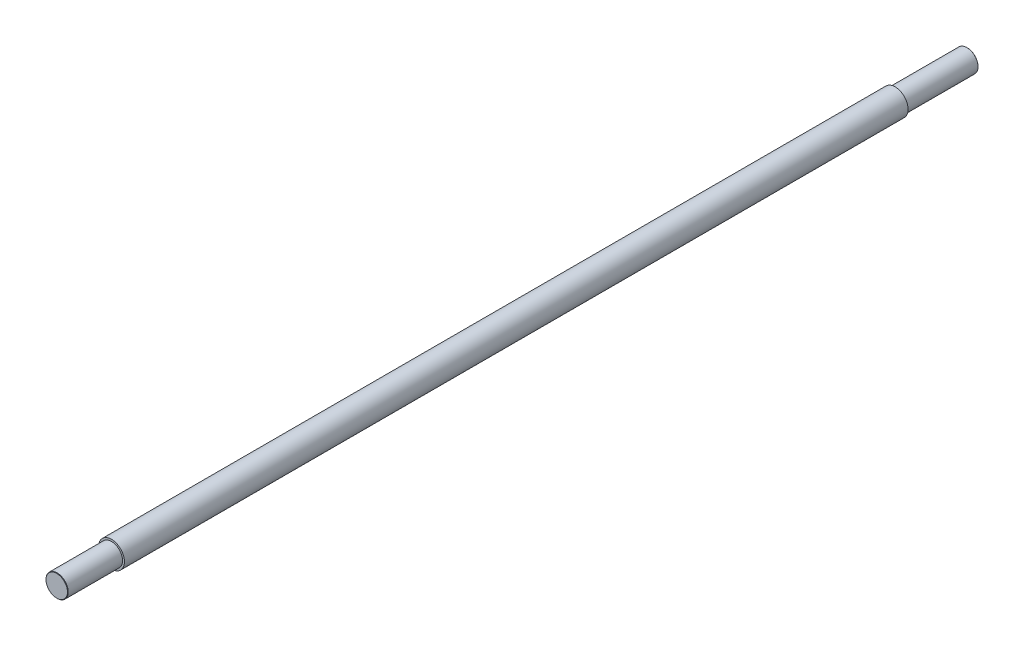
ISO-10303-21;
HEADER;
FILE_DESCRIPTION(('STEP AP214'),'2;1');
FILE_NAME('part.step','',(''),(''),'','','');
FILE_SCHEMA(('AUTOMOTIVE_DESIGN { 1 0 10303 214 1 1 1 1 }'));
ENDSEC;
DATA;
#1=APPLICATION_CONTEXT('core data for automotive mechanical design processes');
#2=APPLICATION_PROTOCOL_DEFINITION('international standard','automotive_design',2000,#1);
#3=PRODUCT_CONTEXT('',#1,'mechanical');
#4=PRODUCT('Part','Part','',(#3));
#5=PRODUCT_RELATED_PRODUCT_CATEGORY('part','',(#4));
#6=PRODUCT_DEFINITION_FORMATION('','',#4);
#7=PRODUCT_DEFINITION_CONTEXT('part definition',#1,'design');
#8=PRODUCT_DEFINITION('design','',#6,#7);
#9=PRODUCT_DEFINITION_SHAPE('','',#8);
#10=(LENGTH_UNIT() NAMED_UNIT(*) SI_UNIT(.MILLI.,.METRE.));
#11=(NAMED_UNIT(*) PLANE_ANGLE_UNIT() SI_UNIT($,.RADIAN.));
#12=(NAMED_UNIT(*) SI_UNIT($,.STERADIAN.) SOLID_ANGLE_UNIT());
#13=UNCERTAINTY_MEASURE_WITH_UNIT(LENGTH_MEASURE(1.E-05),#10,'distance_accuracy_value','');
#14=(GEOMETRIC_REPRESENTATION_CONTEXT(3) GLOBAL_UNCERTAINTY_ASSIGNED_CONTEXT((#13)) GLOBAL_UNIT_ASSIGNED_CONTEXT((#10,
#11,#12)) REPRESENTATION_CONTEXT('',''));
#15=CARTESIAN_POINT('',(0.,0.,0.));
#16=DIRECTION('',(0.,0.,1.));
#17=DIRECTION('',(1.,0.,0.));
#18=AXIS2_PLACEMENT_3D('',#15,#16,#17);
#19=CARTESIAN_POINT('',(0.,0.,0.));
#20=DIRECTION('',(0.,0.,-1.));
#21=DIRECTION('',(0.,1.,0.));
#22=AXIS2_PLACEMENT_3D('',#19,#20,#21);
#23=PLANE('',#22);
#24=CARTESIAN_POINT('',(0.,0.,0.));
#25=DIRECTION('',(0.,0.,-1.));
#26=DIRECTION('',(0.,1.,0.));
#27=AXIS2_PLACEMENT_3D('',#24,#25,#26);
#28=CIRCLE('',#27,28.9999999999999);
#29=CARTESIAN_POINT('',(0.,28.9999999999999,0.));
#30=VERTEX_POINT('',#29);
#31=EDGE_CURVE('E39',#30,#30,#28,.F.);
#32=ORIENTED_EDGE('',*,*,#31,.T.);
#33=EDGE_LOOP('',(#32));
#34=FACE_BOUND('',#33,.T.);
#35=ADVANCED_FACE('F32',(#34),#23,.F.);
#36=CARTESIAN_POINT('',(0.,0.,0.));
#37=DIRECTION('',(0.,0.,1.));
#38=DIRECTION('',(0.,-1.,0.));
#39=AXIS2_PLACEMENT_3D('',#36,#37,#38);
#40=CYLINDRICAL_SURFACE('',#39,29.9999999999997);
#41=CARTESIAN_POINT('',(0.,0.,-1.0000000000001));
#42=DIRECTION('',(0.,0.,-1.));
#43=DIRECTION('',(0.,1.,0.));
#44=AXIS2_PLACEMENT_3D('',#41,#42,#43);
#45=CIRCLE('',#44,29.9999999999997);
#46=CARTESIAN_POINT('',(0.,29.9999999999997,-1.0000000000001));
#47=VERTEX_POINT('',#46);
#48=EDGE_CURVE('E10',#47,#47,#45,.T.);
#49=ORIENTED_EDGE('',*,*,#48,.T.);
#50=EDGE_LOOP('',(#49));
#51=FACE_BOUND('',#50,.T.);
#52=CARTESIAN_POINT('',(0.,0.,-148.));
#53=DIRECTION('',(0.,0.,1.));
#54=DIRECTION('',(0.,-1.,0.));
#55=AXIS2_PLACEMENT_3D('',#52,#53,#54);
#56=CIRCLE('',#55,29.9999999999997);
#57=CARTESIAN_POINT('',(0.,-29.9999999999997,-148.));
#58=VERTEX_POINT('',#57);
#59=EDGE_CURVE('E52',#58,#58,#56,.T.);
#60=ORIENTED_EDGE('',*,*,#59,.T.);
#61=EDGE_LOOP('',(#60));
#62=FACE_BOUND('',#61,.T.);
#63=ADVANCED_FACE('F83',(#51,#62),#40,.T.);
#64=CARTESIAN_POINT('',(0.,29.9999999999997,-148.));
#65=DIRECTION('',(0.,0.,-1.));
#66=DIRECTION('',(0.,1.,0.));
#67=AXIS2_PLACEMENT_3D('',#64,#65,#66);
#68=PLANE('',#67);
#69=ORIENTED_EDGE('',*,*,#59,.F.);
#70=EDGE_LOOP('',(#69));
#71=FACE_BOUND('',#70,.T.);
#72=CARTESIAN_POINT('',(0.,0.,-148.));
#73=DIRECTION('',(0.,0.,1.));
#74=DIRECTION('',(0.,-1.,0.));
#75=AXIS2_PLACEMENT_3D('',#72,#73,#74);
#76=CIRCLE('',#75,34.9999999999997);
#77=CARTESIAN_POINT('',(0.,-34.9999999999997,-148.));
#78=VERTEX_POINT('',#77);
#79=EDGE_CURVE('E55',#78,#78,#76,.T.);
#80=ORIENTED_EDGE('',*,*,#79,.T.);
#81=EDGE_LOOP('',(#80));
#82=FACE_BOUND('',#81,.T.);
#83=ADVANCED_FACE('F88',(#71,#82),#68,.F.);
#84=CARTESIAN_POINT('',(0.,0.,0.));
#85=DIRECTION('',(0.,0.,1.));
#86=DIRECTION('',(0.,-1.,0.));
#87=AXIS2_PLACEMENT_3D('',#84,#85,#86);
#88=CYLINDRICAL_SURFACE('',#87,34.9999999999997);
#89=ORIENTED_EDGE('',*,*,#79,.F.);
#90=EDGE_LOOP('',(#89));
#91=FACE_BOUND('',#90,.T.);
#92=CARTESIAN_POINT('',(0.,0.,-2266.));
#93=DIRECTION('',(0.,0.,1.));
#94=DIRECTION('',(0.,-1.,0.));
#95=AXIS2_PLACEMENT_3D('',#92,#93,#94);
#96=CIRCLE('',#95,34.9999999999997);
#97=CARTESIAN_POINT('',(0.,-34.9999999999997,-2266.));
#98=VERTEX_POINT('',#97);
#99=EDGE_CURVE('E58',#98,#98,#96,.T.);
#100=ORIENTED_EDGE('',*,*,#99,.T.);
#101=EDGE_LOOP('',(#100));
#102=FACE_BOUND('',#101,.T.);
#103=ADVANCED_FACE('F79',(#91,#102),#88,.T.);
#104=CARTESIAN_POINT('',(0.,34.9999999999997,-2266.));
#105=DIRECTION('',(0.,0.,1.));
#106=DIRECTION('',(0.,-1.,0.));
#107=AXIS2_PLACEMENT_3D('',#104,#105,#106);
#108=PLANE('',#107);
#109=ORIENTED_EDGE('',*,*,#99,.F.);
#110=EDGE_LOOP('',(#109));
#111=FACE_BOUND('',#110,.T.);
#112=CARTESIAN_POINT('',(0.,0.,-2266.));
#113=DIRECTION('',(0.,0.,1.));
#114=DIRECTION('',(0.,-1.,0.));
#115=AXIS2_PLACEMENT_3D('',#112,#113,#114);
#116=CIRCLE('',#115,30.);
#117=CARTESIAN_POINT('',(0.,-30.,-2266.));
#118=VERTEX_POINT('',#117);
#119=EDGE_CURVE('E61',#118,#118,#116,.T.);
#120=ORIENTED_EDGE('',*,*,#119,.T.);
#121=EDGE_LOOP('',(#120));
#122=FACE_BOUND('',#121,.T.);
#123=ADVANCED_FACE('F65',(#111,#122),#108,.F.);
#124=CARTESIAN_POINT('',(0.,0.,0.));
#125=DIRECTION('',(0.,0.,1.));
#126=DIRECTION('',(0.,-1.,0.));
#127=AXIS2_PLACEMENT_3D('',#124,#125,#126);
#128=CYLINDRICAL_SURFACE('',#127,30.);
#129=CARTESIAN_POINT('',(0.,0.,-2460.));
#130=DIRECTION('',(0.,0.,1.));
#131=DIRECTION('',(0.,-1.,0.));
#132=AXIS2_PLACEMENT_3D('',#129,#130,#131);
#133=CIRCLE('',#132,30.);
#134=CARTESIAN_POINT('',(0.,-30.,-2460.));
#135=VERTEX_POINT('',#134);
#136=EDGE_CURVE('E47',#135,#135,#133,.T.);
#137=ORIENTED_EDGE('',*,*,#136,.T.);
#138=EDGE_LOOP('',(#137));
#139=FACE_BOUND('',#138,.T.);
#140=ORIENTED_EDGE('',*,*,#119,.F.);
#141=EDGE_LOOP('',(#140));
#142=FACE_BOUND('',#141,.T.);
#143=ADVANCED_FACE('F67',(#139,#142),#128,.T.);
#144=CARTESIAN_POINT('',(0.,30.,-2461.));
#145=DIRECTION('',(0.,0.,1.));
#146=DIRECTION('',(0.,-1.,0.));
#147=AXIS2_PLACEMENT_3D('',#144,#145,#146);
#148=PLANE('',#147);
#149=CARTESIAN_POINT('',(0.,0.,-2461.));
#150=DIRECTION('',(0.,0.,1.));
#151=DIRECTION('',(0.,-1.,0.));
#152=AXIS2_PLACEMENT_3D('',#149,#150,#151);
#153=CIRCLE('',#152,29.0000000000004);
#154=CARTESIAN_POINT('',(0.,-29.0000000000004,-2461.));
#155=VERTEX_POINT('',#154);
#156=EDGE_CURVE('E43',#155,#155,#153,.F.);
#157=ORIENTED_EDGE('',*,*,#156,.T.);
#158=EDGE_LOOP('',(#157));
#159=FACE_BOUND('',#158,.T.);
#160=ADVANCED_FACE('F69',(#159),#148,.F.);
#161=CARTESIAN_POINT('',(0.,0.,-2460.));
#162=DIRECTION('',(0.,0.,1.));
#163=DIRECTION('',(0.,-1.,0.));
#164=AXIS2_PLACEMENT_3D('',#161,#162,#163);
#165=CONICAL_SURFACE('',#164,30.,0.78539816339731);
#166=ORIENTED_EDGE('',*,*,#156,.F.);
#167=EDGE_LOOP('',(#166));
#168=FACE_BOUND('',#167,.T.);
#169=ORIENTED_EDGE('',*,*,#136,.F.);
#170=EDGE_LOOP('',(#169));
#171=FACE_BOUND('',#170,.T.);
#172=ADVANCED_FACE('F76',(#168,#171),#165,.T.);
#173=CARTESIAN_POINT('',(0.,0.,0.));
#174=DIRECTION('',(0.,0.,-1.));
#175=DIRECTION('',(0.,1.,0.));
#176=AXIS2_PLACEMENT_3D('',#173,#174,#175);
#177=CONICAL_SURFACE('',#176,28.9999999999999,0.785398163397287);
#178=ORIENTED_EDGE('',*,*,#48,.F.);
#179=EDGE_LOOP('',(#178));
#180=FACE_BOUND('',#179,.T.);
#181=ORIENTED_EDGE('',*,*,#31,.F.);
#182=EDGE_LOOP('',(#181));
#183=FACE_BOUND('',#182,.T.);
#184=ADVANCED_FACE('F34',(#180,#183),#177,.T.);
#185=CLOSED_SHELL('',(#35,#63,#83,#103,#123,#143,#160,#172,#184));
#186=MANIFOLD_SOLID_BREP('B2',#185);
#187=ADVANCED_BREP_SHAPE_REPRESENTATION('',(#18,#186),#14);
#188=SHAPE_DEFINITION_REPRESENTATION(#9,#187);
ENDSEC;
END-ISO-10303-21;
